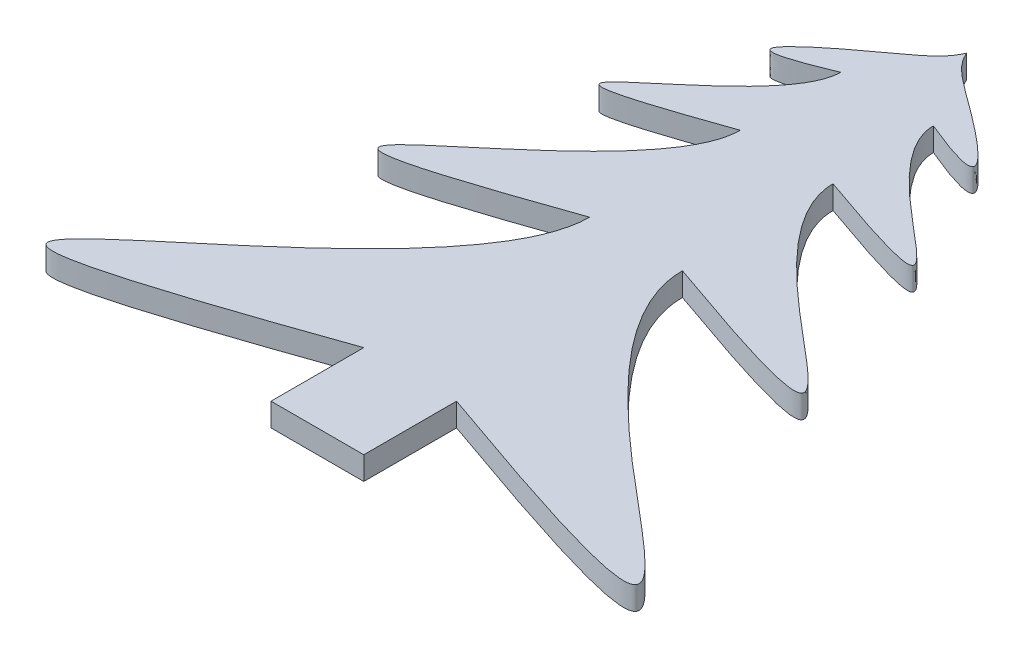
ISO-10303-21;
HEADER;
FILE_DESCRIPTION(('STEP AP214'),'2;1');
FILE_NAME('part.step','',(''),(''),'','','');
FILE_SCHEMA(('AUTOMOTIVE_DESIGN { 1 0 10303 214 1 1 1 1 }'));
ENDSEC;
DATA;
#1=APPLICATION_CONTEXT('core data for automotive mechanical design processes');
#2=APPLICATION_PROTOCOL_DEFINITION('international standard','automotive_design',2000,#1);
#3=PRODUCT_CONTEXT('',#1,'mechanical');
#4=PRODUCT('Part','Part','',(#3));
#5=PRODUCT_RELATED_PRODUCT_CATEGORY('part','',(#4));
#6=PRODUCT_DEFINITION_FORMATION('','',#4);
#7=PRODUCT_DEFINITION_CONTEXT('part definition',#1,'design');
#8=PRODUCT_DEFINITION('design','',#6,#7);
#9=PRODUCT_DEFINITION_SHAPE('','',#8);
#10=(LENGTH_UNIT() NAMED_UNIT(*) SI_UNIT(.MILLI.,.METRE.));
#11=(NAMED_UNIT(*) PLANE_ANGLE_UNIT() SI_UNIT($,.RADIAN.));
#12=(NAMED_UNIT(*) SI_UNIT($,.STERADIAN.) SOLID_ANGLE_UNIT());
#13=UNCERTAINTY_MEASURE_WITH_UNIT(LENGTH_MEASURE(1.E-05),#10,'distance_accuracy_value','');
#14=(GEOMETRIC_REPRESENTATION_CONTEXT(3) GLOBAL_UNCERTAINTY_ASSIGNED_CONTEXT((#13)) GLOBAL_UNIT_ASSIGNED_CONTEXT((#10,
#11,#12)) REPRESENTATION_CONTEXT('',''));
#15=CARTESIAN_POINT('',(0.,0.,0.));
#16=DIRECTION('',(0.,0.,1.));
#17=DIRECTION('',(1.,0.,0.));
#18=AXIS2_PLACEMENT_3D('',#15,#16,#17);
#19=CARTESIAN_POINT('',(-6.35,-3.175,-12.7));
#20=DIRECTION('',(-1.,0.,0.));
#21=DIRECTION('',(0.,0.,1.));
#22=AXIS2_PLACEMENT_3D('',#19,#20,#21);
#23=PLANE('',#22);
#24=DIRECTION('',(0.,0.,1.));
#25=VECTOR('',#24,1.);
#26=CARTESIAN_POINT('',(-6.35,0.,-12.7));
#27=LINE('',#26,#25);
#28=CARTESIAN_POINT('',(-6.35,0.,-25.4));
#29=VERTEX_POINT('',#28);
#30=CARTESIAN_POINT('',(-6.35,0.,-12.7));
#31=VERTEX_POINT('',#30);
#32=EDGE_CURVE('E229',#29,#31,#27,.T.);
#33=ORIENTED_EDGE('',*,*,#32,.F.);
#34=DIRECTION('',(0.,1.,0.));
#35=VECTOR('',#34,1.);
#36=CARTESIAN_POINT('',(-6.35,-3.175,-25.4));
#37=LINE('',#36,#35);
#38=CARTESIAN_POINT('',(-6.35,-3.175,-25.4));
#39=VERTEX_POINT('',#38);
#40=EDGE_CURVE('E11',#39,#29,#37,.T.);
#41=ORIENTED_EDGE('',*,*,#40,.F.);
#42=DIRECTION('',(0.,0.,1.));
#43=VECTOR('',#42,1.);
#44=CARTESIAN_POINT('',(-6.35,-3.175,-12.7));
#45=LINE('',#44,#43);
#46=CARTESIAN_POINT('',(-6.35,-3.175,-12.7));
#47=VERTEX_POINT('',#46);
#48=EDGE_CURVE('E236',#39,#47,#45,.T.);
#49=ORIENTED_EDGE('',*,*,#48,.T.);
#50=DIRECTION('',(0.,1.,0.));
#51=VECTOR('',#50,1.);
#52=CARTESIAN_POINT('',(-6.35,-3.175,-12.7));
#53=LINE('',#52,#51);
#54=EDGE_CURVE('E36',#47,#31,#53,.T.);
#55=ORIENTED_EDGE('',*,*,#54,.T.);
#56=EDGE_LOOP('',(#33,#41,#49,#55));
#57=FACE_BOUND('',#56,.T.);
#58=ADVANCED_FACE('F33',(#57),#23,.T.);
#59=CARTESIAN_POINT('',(-6.35,-3.175,-56.3283131146132));
#60=CARTESIAN_POINT('',(-6.33277041950557,-3.175,-33.5311693678692));
#61=CARTESIAN_POINT('',(-83.156548094866,-3.175,1.79807398287877));
#62=CARTESIAN_POINT('',(-6.35,-3.175,-25.4));
#63=B_SPLINE_CURVE_WITH_KNOTS('',3,(#59,#60,#61,#62),.UNSPECIFIED.,.F.,.F.,(4,4),(0.,1.),.UNSPECIFIED.);
#64=DIRECTION('',(0.,1.,0.));
#65=VECTOR('',#64,1.);
#66=SURFACE_OF_LINEAR_EXTRUSION('',#63,#65);
#67=CARTESIAN_POINT('',(-6.35,0.,-56.3283131146132));
#68=CARTESIAN_POINT('',(-6.33277041950557,0.,-33.5311693678692));
#69=CARTESIAN_POINT('',(-83.156548094866,0.,1.79807398287877));
#70=CARTESIAN_POINT('',(-6.35,0.,-25.4));
#71=B_SPLINE_CURVE_WITH_KNOTS('',3,(#67,#68,#69,#70),.UNSPECIFIED.,.F.,.F.,(4,4),(0.,1.),.UNSPECIFIED.);
#72=CARTESIAN_POINT('',(-6.34999999999998,0.,-56.3283131146132));
#73=VERTEX_POINT('',#72);
#74=EDGE_CURVE('E235',#73,#29,#71,.T.);
#75=ORIENTED_EDGE('',*,*,#74,.F.);
#76=DIRECTION('',(0.,1.,0.));
#77=VECTOR('',#76,1.);
#78=CARTESIAN_POINT('',(-6.34999999999998,-3.175,-56.3283131146132));
#79=LINE('',#78,#77);
#80=CARTESIAN_POINT('',(-6.34999999999998,-3.175,-56.3283131146132));
#81=VERTEX_POINT('',#80);
#82=EDGE_CURVE('E42',#81,#73,#79,.T.);
#83=ORIENTED_EDGE('',*,*,#82,.F.);
#84=EDGE_CURVE('E138',#81,#39,#63,.T.);
#85=ORIENTED_EDGE('',*,*,#84,.T.);
#86=ORIENTED_EDGE('',*,*,#40,.T.);
#87=EDGE_LOOP('',(#75,#83,#85,#86));
#88=FACE_BOUND('',#87,.T.);
#89=ADVANCED_FACE('F224',(#88),#66,.T.);
#90=CARTESIAN_POINT('',(-6.35,-3.175,-76.9471885243553));
#91=CARTESIAN_POINT('',(-6.33851361300371,-3.175,-61.7490926931926));
#92=CARTESIAN_POINT('',(-57.5543653965774,-3.175,-38.196263792694));
#93=CARTESIAN_POINT('',(-6.34999999999998,-3.175,-56.3283131146132));
#94=B_SPLINE_CURVE_WITH_KNOTS('',3,(#90,#91,#92,#93),.UNSPECIFIED.,.F.,.F.,(4,4),(0.,1.),.UNSPECIFIED.);
#95=DIRECTION('',(0.,1.,0.));
#96=VECTOR('',#95,1.);
#97=SURFACE_OF_LINEAR_EXTRUSION('',#94,#96);
#98=CARTESIAN_POINT('',(-6.35,0.,-76.9471885243553));
#99=CARTESIAN_POINT('',(-6.33851361300371,0.,-61.7490926931926));
#100=CARTESIAN_POINT('',(-57.5543653965774,0.,-38.196263792694));
#101=CARTESIAN_POINT('',(-6.34999999999998,0.,-56.3283131146132));
#102=B_SPLINE_CURVE_WITH_KNOTS('',3,(#98,#99,#100,#101),.UNSPECIFIED.,.F.,.F.,(4,4),(0.,1.),.UNSPECIFIED.);
#103=CARTESIAN_POINT('',(-6.35,0.,-76.9471885243553));
#104=VERTEX_POINT('',#103);
#105=EDGE_CURVE('E125',#104,#73,#102,.T.);
#106=ORIENTED_EDGE('',*,*,#105,.F.);
#107=DIRECTION('',(0.,1.,0.));
#108=VECTOR('',#107,1.);
#109=CARTESIAN_POINT('',(-6.35,-3.175,-76.9471885243553));
#110=LINE('',#109,#108);
#111=CARTESIAN_POINT('',(-6.35,-3.175,-76.9471885243553));
#112=VERTEX_POINT('',#111);
#113=EDGE_CURVE('E120',#112,#104,#110,.T.);
#114=ORIENTED_EDGE('',*,*,#113,.F.);
#115=EDGE_CURVE('E123',#112,#81,#94,.T.);
#116=ORIENTED_EDGE('',*,*,#115,.T.);
#117=ORIENTED_EDGE('',*,*,#82,.T.);
#118=EDGE_LOOP('',(#106,#114,#116,#117));
#119=FACE_BOUND('',#118,.T.);
#120=ADVANCED_FACE('F122',(#119),#97,.T.);
#121=CARTESIAN_POINT('',(-6.35,-3.175,-90.6931054641834));
#122=CARTESIAN_POINT('',(-6.34234240866914,-3.175,-80.5610415767416));
#123=CARTESIAN_POINT('',(-40.4862435977182,-3.175,-64.8591556430758));
#124=CARTESIAN_POINT('',(-6.35,-3.175,-76.9471885243553));
#125=B_SPLINE_CURVE_WITH_KNOTS('',3,(#121,#122,#123,#124),.UNSPECIFIED.,.F.,.F.,(4,4),(0.,1.),.UNSPECIFIED.);
#126=DIRECTION('',(0.,1.,0.));
#127=VECTOR('',#126,1.);
#128=SURFACE_OF_LINEAR_EXTRUSION('',#125,#127);
#129=CARTESIAN_POINT('',(-6.35,0.,-90.6931054641834));
#130=CARTESIAN_POINT('',(-6.34234240866914,0.,-80.5610415767416));
#131=CARTESIAN_POINT('',(-40.4862435977182,0.,-64.8591556430758));
#132=CARTESIAN_POINT('',(-6.35,0.,-76.9471885243553));
#133=B_SPLINE_CURVE_WITH_KNOTS('',3,(#129,#130,#131,#132),.UNSPECIFIED.,.F.,.F.,(4,4),(0.,1.),.UNSPECIFIED.);
#134=CARTESIAN_POINT('',(-6.34999999999999,0.,-90.6931054641834));
#135=VERTEX_POINT('',#134);
#136=EDGE_CURVE('E240',#135,#104,#133,.T.);
#137=ORIENTED_EDGE('',*,*,#136,.F.);
#138=DIRECTION('',(0.,1.,0.));
#139=VECTOR('',#138,1.);
#140=CARTESIAN_POINT('',(-6.34999999999999,-3.175,-90.6931054641834));
#141=LINE('',#140,#139);
#142=CARTESIAN_POINT('',(-6.34999999999999,-3.175,-90.6931054641834));
#143=VERTEX_POINT('',#142);
#144=EDGE_CURVE('E130',#143,#135,#141,.T.);
#145=ORIENTED_EDGE('',*,*,#144,.F.);
#146=EDGE_CURVE('E136',#143,#112,#125,.T.);
#147=ORIENTED_EDGE('',*,*,#146,.T.);
#148=ORIENTED_EDGE('',*,*,#113,.T.);
#149=EDGE_LOOP('',(#137,#145,#147,#148));
#150=FACE_BOUND('',#149,.T.);
#151=ADVANCED_FACE('F140',(#150),#128,.T.);
#152=CARTESIAN_POINT('',(0.,-3.175,-101.6));
#153=CARTESIAN_POINT('',(-0.859116350895078,-3.175,-99.5016416094337));
#154=CARTESIAN_POINT('',(-8.04674624001071,-3.175,-94.5428232817993));
#155=CARTESIAN_POINT('',(-20.6251459463282,-3.175,-84.6845631883274));
#156=CARTESIAN_POINT('',(-6.34999999999999,-3.175,-90.6931054641834));
#157=B_SPLINE_CURVE_WITH_KNOTS('',3,(#152,#153,#154,#155,#156),.UNSPECIFIED.,.F.,.F.,(4,1,4),
(0.,0.277088290011311,1.),.UNSPECIFIED.);
#158=DIRECTION('',(0.,1.,0.));
#159=VECTOR('',#158,1.);
#160=SURFACE_OF_LINEAR_EXTRUSION('',#157,#159);
#161=CARTESIAN_POINT('',(0.,0.,-101.6));
#162=CARTESIAN_POINT('',(-0.859116350895078,0.,-99.5016416094337));
#163=CARTESIAN_POINT('',(-8.04674624001071,0.,-94.5428232817993));
#164=CARTESIAN_POINT('',(-20.6251459463282,0.,-84.6845631883274));
#165=CARTESIAN_POINT('',(-6.34999999999999,0.,-90.6931054641834));
#166=B_SPLINE_CURVE_WITH_KNOTS('',3,(#161,#162,#163,#164,#165),.UNSPECIFIED.,.F.,.F.,(4,1,4),
(0.,0.277088290011311,1.),.UNSPECIFIED.);
#167=CARTESIAN_POINT('',(0.,0.,-101.6));
#168=VERTEX_POINT('',#167);
#169=EDGE_CURVE('E383',#168,#135,#166,.T.);
#170=ORIENTED_EDGE('',*,*,#169,.F.);
#171=DIRECTION('',(0.,1.,0.));
#172=VECTOR('',#171,1.);
#173=CARTESIAN_POINT('',(0.,-3.175,-101.6));
#174=LINE('',#173,#172);
#175=CARTESIAN_POINT('',(0.,-3.175,-101.6));
#176=VERTEX_POINT('',#175);
#177=EDGE_CURVE('E253',#176,#168,#174,.T.);
#178=ORIENTED_EDGE('',*,*,#177,.F.);
#179=EDGE_CURVE('E141',#176,#143,#157,.T.);
#180=ORIENTED_EDGE('',*,*,#179,.T.);
#181=ORIENTED_EDGE('',*,*,#144,.T.);
#182=EDGE_LOOP('',(#170,#178,#180,#181));
#183=FACE_BOUND('',#182,.T.);
#184=ADVANCED_FACE('F163',(#183),#160,.T.);
#185=CARTESIAN_POINT('',(6.34999999999999,-3.175,-90.6931054641834));
#186=CARTESIAN_POINT('',(20.6251459463282,-3.175,-84.6845631883274));
#187=CARTESIAN_POINT('',(8.04674624001071,-3.175,-94.5428232817993));
#188=CARTESIAN_POINT('',(0.859116350895078,-3.175,-99.5016416094337));
#189=CARTESIAN_POINT('',(0.,-3.175,-101.6));
#190=B_SPLINE_CURVE_WITH_KNOTS('',3,(#185,#186,#187,#188,#189),.UNSPECIFIED.,.F.,.F.,(4,1,4),
(0.,0.722911709988689,1.),.UNSPECIFIED.);
#191=DIRECTION('',(0.,1.,0.));
#192=VECTOR('',#191,1.);
#193=SURFACE_OF_LINEAR_EXTRUSION('',#190,#192);
#194=CARTESIAN_POINT('',(6.34999999999999,0.,-90.6931054641834));
#195=CARTESIAN_POINT('',(20.6251459463282,0.,-84.6845631883274));
#196=CARTESIAN_POINT('',(8.04674624001071,0.,-94.5428232817993));
#197=CARTESIAN_POINT('',(0.859116350895078,0.,-99.5016416094337));
#198=CARTESIAN_POINT('',(0.,0.,-101.6));
#199=B_SPLINE_CURVE_WITH_KNOTS('',3,(#194,#195,#196,#197,#198),.UNSPECIFIED.,.F.,.F.,(4,1,4),
(0.,0.722911709988689,1.),.UNSPECIFIED.);
#200=CARTESIAN_POINT('',(6.35,0.,-90.6931054641834));
#201=VERTEX_POINT('',#200);
#202=EDGE_CURVE('E355',#201,#168,#199,.T.);
#203=ORIENTED_EDGE('',*,*,#202,.F.);
#204=DIRECTION('',(0.,1.,0.));
#205=VECTOR('',#204,1.);
#206=CARTESIAN_POINT('',(6.35,-3.175,-90.6931054641834));
#207=LINE('',#206,#205);
#208=CARTESIAN_POINT('',(6.35,-3.175,-90.6931054641834));
#209=VERTEX_POINT('',#208);
#210=EDGE_CURVE('E255',#209,#201,#207,.T.);
#211=ORIENTED_EDGE('',*,*,#210,.F.);
#212=EDGE_CURVE('E143',#209,#176,#190,.T.);
#213=ORIENTED_EDGE('',*,*,#212,.T.);
#214=ORIENTED_EDGE('',*,*,#177,.T.);
#215=EDGE_LOOP('',(#203,#211,#213,#214));
#216=FACE_BOUND('',#215,.T.);
#217=ADVANCED_FACE('F167',(#216),#193,.T.);
#218=CARTESIAN_POINT('',(6.35,-3.175,-76.9471885243553));
#219=CARTESIAN_POINT('',(40.4862435977182,-3.175,-64.8591556430758));
#220=CARTESIAN_POINT('',(6.34234240866914,-3.175,-80.5610415767416));
#221=CARTESIAN_POINT('',(6.35,-3.175,-90.6931054641834));
#222=B_SPLINE_CURVE_WITH_KNOTS('',3,(#218,#219,#220,#221),.UNSPECIFIED.,.F.,.F.,(4,4),(0.,1.),.UNSPECIFIED.);
#223=DIRECTION('',(0.,1.,0.));
#224=VECTOR('',#223,1.);
#225=SURFACE_OF_LINEAR_EXTRUSION('',#222,#224);
#226=CARTESIAN_POINT('',(6.35,0.,-76.9471885243553));
#227=CARTESIAN_POINT('',(40.4862435977182,0.,-64.8591556430758));
#228=CARTESIAN_POINT('',(6.34234240866914,0.,-80.5610415767416));
#229=CARTESIAN_POINT('',(6.35,0.,-90.6931054641834));
#230=B_SPLINE_CURVE_WITH_KNOTS('',3,(#226,#227,#228,#229),.UNSPECIFIED.,.F.,.F.,(4,4),(0.,1.),.UNSPECIFIED.);
#231=CARTESIAN_POINT('',(6.35,0.,-76.9471885243553));
#232=VERTEX_POINT('',#231);
#233=EDGE_CURVE('E350',#232,#201,#230,.T.);
#234=ORIENTED_EDGE('',*,*,#233,.F.);
#235=DIRECTION('',(0.,1.,0.));
#236=VECTOR('',#235,1.);
#237=CARTESIAN_POINT('',(6.35,-3.175,-76.9471885243553));
#238=LINE('',#237,#236);
#239=CARTESIAN_POINT('',(6.35,-3.175,-76.9471885243553));
#240=VERTEX_POINT('',#239);
#241=EDGE_CURVE('E257',#240,#232,#238,.T.);
#242=ORIENTED_EDGE('',*,*,#241,.F.);
#243=EDGE_CURVE('E179',#240,#209,#222,.T.);
#244=ORIENTED_EDGE('',*,*,#243,.T.);
#245=ORIENTED_EDGE('',*,*,#210,.T.);
#246=EDGE_LOOP('',(#234,#242,#244,#245));
#247=FACE_BOUND('',#246,.T.);
#248=ADVANCED_FACE('F171',(#247),#225,.T.);
#249=CARTESIAN_POINT('',(6.34999999999998,-3.175,-56.3283131146132));
#250=CARTESIAN_POINT('',(57.5543653965774,-3.175,-38.196263792694));
#251=CARTESIAN_POINT('',(6.33851361300371,-3.175,-61.7490926931927));
#252=CARTESIAN_POINT('',(6.35,-3.175,-76.9471885243553));
#253=B_SPLINE_CURVE_WITH_KNOTS('',3,(#249,#250,#251,#252),.UNSPECIFIED.,.F.,.F.,(4,4),(0.,1.),.UNSPECIFIED.);
#254=DIRECTION('',(0.,1.,0.));
#255=VECTOR('',#254,1.);
#256=SURFACE_OF_LINEAR_EXTRUSION('',#253,#255);
#257=CARTESIAN_POINT('',(6.34999999999998,0.,-56.3283131146132));
#258=CARTESIAN_POINT('',(57.5543653965774,0.,-38.196263792694));
#259=CARTESIAN_POINT('',(6.33851361300371,0.,-61.7490926931927));
#260=CARTESIAN_POINT('',(6.35,0.,-76.9471885243553));
#261=B_SPLINE_CURVE_WITH_KNOTS('',3,(#257,#258,#259,#260),.UNSPECIFIED.,.F.,.F.,(4,4),(0.,1.),.UNSPECIFIED.);
#262=CARTESIAN_POINT('',(6.35,0.,-56.3283131146132));
#263=VERTEX_POINT('',#262);
#264=EDGE_CURVE('E356',#263,#232,#261,.T.);
#265=ORIENTED_EDGE('',*,*,#264,.F.);
#266=DIRECTION('',(0.,1.,0.));
#267=VECTOR('',#266,1.);
#268=CARTESIAN_POINT('',(6.35,-3.175,-56.3283131146132));
#269=LINE('',#268,#267);
#270=CARTESIAN_POINT('',(6.35,-3.175,-56.3283131146132));
#271=VERTEX_POINT('',#270);
#272=EDGE_CURVE('E259',#271,#263,#269,.T.);
#273=ORIENTED_EDGE('',*,*,#272,.F.);
#274=EDGE_CURVE('E188',#271,#240,#253,.T.);
#275=ORIENTED_EDGE('',*,*,#274,.T.);
#276=ORIENTED_EDGE('',*,*,#241,.T.);
#277=EDGE_LOOP('',(#265,#273,#275,#276));
#278=FACE_BOUND('',#277,.T.);
#279=ADVANCED_FACE('F205',(#278),#256,.T.);
#280=CARTESIAN_POINT('',(6.35,-3.175,-25.4));
#281=CARTESIAN_POINT('',(83.156548094866,-3.175,1.79807398287877));
#282=CARTESIAN_POINT('',(6.33277041950557,-3.175,-33.5311693678692));
#283=CARTESIAN_POINT('',(6.35,-3.175,-56.3283131146132));
#284=B_SPLINE_CURVE_WITH_KNOTS('',3,(#280,#281,#282,#283),.UNSPECIFIED.,.F.,.F.,(4,4),(0.,1.),.UNSPECIFIED.);
#285=DIRECTION('',(0.,1.,0.));
#286=VECTOR('',#285,1.);
#287=SURFACE_OF_LINEAR_EXTRUSION('',#284,#286);
#288=CARTESIAN_POINT('',(6.35,0.,-25.4));
#289=CARTESIAN_POINT('',(83.156548094866,0.,1.79807398287877));
#290=CARTESIAN_POINT('',(6.33277041950557,0.,-33.5311693678692));
#291=CARTESIAN_POINT('',(6.35,0.,-56.3283131146132));
#292=B_SPLINE_CURVE_WITH_KNOTS('',3,(#288,#289,#290,#291),.UNSPECIFIED.,.F.,.F.,(4,4),(0.,1.),.UNSPECIFIED.);
#293=CARTESIAN_POINT('',(6.35,0.,-25.4));
#294=VERTEX_POINT('',#293);
#295=EDGE_CURVE('E362',#294,#263,#292,.T.);
#296=ORIENTED_EDGE('',*,*,#295,.F.);
#297=DIRECTION('',(0.,1.,0.));
#298=VECTOR('',#297,1.);
#299=CARTESIAN_POINT('',(6.35,-3.175,-25.4));
#300=LINE('',#299,#298);
#301=CARTESIAN_POINT('',(6.35,-3.175,-25.4));
#302=VERTEX_POINT('',#301);
#303=EDGE_CURVE('E261',#302,#294,#300,.T.);
#304=ORIENTED_EDGE('',*,*,#303,.F.);
#305=EDGE_CURVE('E197',#302,#271,#284,.T.);
#306=ORIENTED_EDGE('',*,*,#305,.T.);
#307=ORIENTED_EDGE('',*,*,#272,.T.);
#308=EDGE_LOOP('',(#296,#304,#306,#307));
#309=FACE_BOUND('',#308,.T.);
#310=ADVANCED_FACE('F208',(#309),#287,.T.);
#311=CARTESIAN_POINT('',(6.35,-3.175,-12.7));
#312=DIRECTION('',(1.,0.,0.));
#313=DIRECTION('',(0.,0.,-1.));
#314=AXIS2_PLACEMENT_3D('',#311,#312,#313);
#315=PLANE('',#314);
#316=DIRECTION('',(0.,0.,-1.));
#317=VECTOR('',#316,1.);
#318=CARTESIAN_POINT('',(6.35,0.,-12.7));
#319=LINE('',#318,#317);
#320=CARTESIAN_POINT('',(6.35,0.,-12.7));
#321=VERTEX_POINT('',#320);
#322=EDGE_CURVE('E364',#321,#294,#319,.T.);
#323=ORIENTED_EDGE('',*,*,#322,.F.);
#324=DIRECTION('',(0.,1.,0.));
#325=VECTOR('',#324,1.);
#326=CARTESIAN_POINT('',(6.35,-3.175,-12.7));
#327=LINE('',#326,#325);
#328=CARTESIAN_POINT('',(6.35,-3.175,-12.7));
#329=VERTEX_POINT('',#328);
#330=EDGE_CURVE('E262',#329,#321,#327,.T.);
#331=ORIENTED_EDGE('',*,*,#330,.F.);
#332=DIRECTION('',(0.,0.,-1.));
#333=VECTOR('',#332,1.);
#334=CARTESIAN_POINT('',(6.35,-3.175,-12.7));
#335=LINE('',#334,#333);
#336=EDGE_CURVE('E405',#329,#302,#335,.T.);
#337=ORIENTED_EDGE('',*,*,#336,.T.);
#338=ORIENTED_EDGE('',*,*,#303,.T.);
#339=EDGE_LOOP('',(#323,#331,#337,#338));
#340=FACE_BOUND('',#339,.T.);
#341=ADVANCED_FACE('F212',(#340),#315,.T.);
#342=CARTESIAN_POINT('',(-6.35,-3.175,-12.7));
#343=DIRECTION('',(0.,0.,1.));
#344=DIRECTION('',(1.,0.,0.));
#345=AXIS2_PLACEMENT_3D('',#342,#343,#344);
#346=PLANE('',#345);
#347=DIRECTION('',(1.,0.,0.));
#348=VECTOR('',#347,1.);
#349=CARTESIAN_POINT('',(-6.35,0.,-12.7));
#350=LINE('',#349,#348);
#351=EDGE_CURVE('E233',#31,#321,#350,.T.);
#352=ORIENTED_EDGE('',*,*,#351,.F.);
#353=ORIENTED_EDGE('',*,*,#54,.F.);
#354=DIRECTION('',(1.,0.,0.));
#355=VECTOR('',#354,1.);
#356=CARTESIAN_POINT('',(-6.35,-3.175,-12.7));
#357=LINE('',#356,#355);
#358=EDGE_CURVE('E238',#47,#329,#357,.T.);
#359=ORIENTED_EDGE('',*,*,#358,.T.);
#360=ORIENTED_EDGE('',*,*,#330,.T.);
#361=EDGE_LOOP('',(#352,#353,#359,#360));
#362=FACE_BOUND('',#361,.T.);
#363=ADVANCED_FACE('F215',(#362),#346,.T.);
#364=CARTESIAN_POINT('',(-35.1459944428893,-3.175,-22.1159499086981));
#365=DIRECTION('',(0.,1.,0.));
#366=DIRECTION('',(0.,0.,1.));
#367=AXIS2_PLACEMENT_3D('',#364,#365,#366);
#368=PLANE('',#367);
#369=ORIENTED_EDGE('',*,*,#48,.F.);
#370=ORIENTED_EDGE('',*,*,#84,.F.);
#371=ORIENTED_EDGE('',*,*,#115,.F.);
#372=ORIENTED_EDGE('',*,*,#146,.F.);
#373=ORIENTED_EDGE('',*,*,#179,.F.);
#374=ORIENTED_EDGE('',*,*,#212,.F.);
#375=ORIENTED_EDGE('',*,*,#243,.F.);
#376=ORIENTED_EDGE('',*,*,#274,.F.);
#377=ORIENTED_EDGE('',*,*,#305,.F.);
#378=ORIENTED_EDGE('',*,*,#336,.F.);
#379=ORIENTED_EDGE('',*,*,#358,.F.);
#380=EDGE_LOOP('',(#369,#370,#371,#372,#373,#374,#375,#376,#377,#378,#379));
#381=FACE_BOUND('',#380,.T.);
#382=ADVANCED_FACE('F134',(#381),#368,.F.);
#383=CARTESIAN_POINT('',(-35.1459944428893,0.,-22.1159499086981));
#384=DIRECTION('',(0.,1.,0.));
#385=DIRECTION('',(0.,0.,1.));
#386=AXIS2_PLACEMENT_3D('',#383,#384,#385);
#387=PLANE('',#386);
#388=ORIENTED_EDGE('',*,*,#32,.T.);
#389=ORIENTED_EDGE('',*,*,#351,.T.);
#390=ORIENTED_EDGE('',*,*,#322,.T.);
#391=ORIENTED_EDGE('',*,*,#295,.T.);
#392=ORIENTED_EDGE('',*,*,#264,.T.);
#393=ORIENTED_EDGE('',*,*,#233,.T.);
#394=ORIENTED_EDGE('',*,*,#202,.T.);
#395=ORIENTED_EDGE('',*,*,#169,.T.);
#396=ORIENTED_EDGE('',*,*,#136,.T.);
#397=ORIENTED_EDGE('',*,*,#105,.T.);
#398=ORIENTED_EDGE('',*,*,#74,.T.);
#399=EDGE_LOOP('',(#388,#389,#390,#391,#392,#393,#394,#395,#396,#397,#398));
#400=FACE_BOUND('',#399,.T.);
#401=ADVANCED_FACE('F221',(#400),#387,.T.);
#402=CLOSED_SHELL('',(#58,#89,#120,#151,#184,#217,#248,#279,#310,#341,#363,#382,#401));
#403=MANIFOLD_SOLID_BREP('B2',#402);
#404=ADVANCED_BREP_SHAPE_REPRESENTATION('',(#18,#403),#14);
#405=SHAPE_DEFINITION_REPRESENTATION(#9,#404);
ENDSEC;
END-ISO-10303-21;
